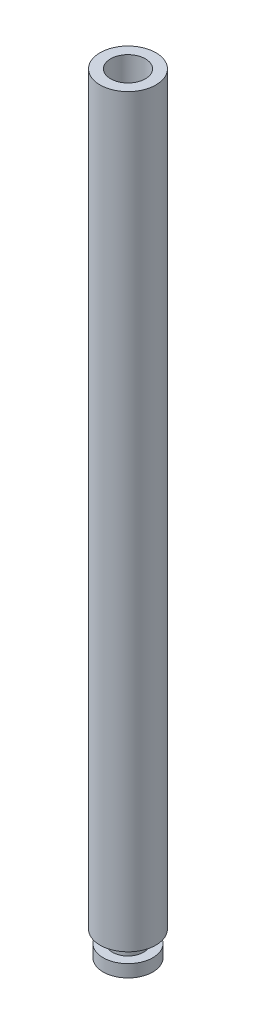
ISO-10303-21;
HEADER;
FILE_DESCRIPTION(('STEP AP214'),'2;1');
FILE_NAME('part.step','',(''),(''),'','','');
FILE_SCHEMA(('AUTOMOTIVE_DESIGN { 1 0 10303 214 1 1 1 1 }'));
ENDSEC;
DATA;
#1=APPLICATION_CONTEXT('core data for automotive mechanical design processes');
#2=APPLICATION_PROTOCOL_DEFINITION('international standard','automotive_design',2000,#1);
#3=PRODUCT_CONTEXT('',#1,'mechanical');
#4=PRODUCT('Part','Part','',(#3));
#5=PRODUCT_RELATED_PRODUCT_CATEGORY('part','',(#4));
#6=PRODUCT_DEFINITION_FORMATION('','',#4);
#7=PRODUCT_DEFINITION_CONTEXT('part definition',#1,'design');
#8=PRODUCT_DEFINITION('design','',#6,#7);
#9=PRODUCT_DEFINITION_SHAPE('','',#8);
#10=(LENGTH_UNIT() NAMED_UNIT(*) SI_UNIT(.MILLI.,.METRE.));
#11=(NAMED_UNIT(*) PLANE_ANGLE_UNIT() SI_UNIT($,.RADIAN.));
#12=(NAMED_UNIT(*) SI_UNIT($,.STERADIAN.) SOLID_ANGLE_UNIT());
#13=UNCERTAINTY_MEASURE_WITH_UNIT(LENGTH_MEASURE(1.E-05),#10,'distance_accuracy_value','');
#14=(GEOMETRIC_REPRESENTATION_CONTEXT(3) GLOBAL_UNCERTAINTY_ASSIGNED_CONTEXT((#13)) GLOBAL_UNIT_ASSIGNED_CONTEXT((#10,
#11,#12)) REPRESENTATION_CONTEXT('',''));
#15=CARTESIAN_POINT('',(0.,0.,0.));
#16=DIRECTION('',(0.,0.,1.));
#17=DIRECTION('',(1.,0.,0.));
#18=AXIS2_PLACEMENT_3D('',#15,#16,#17);
#19=CARTESIAN_POINT('',(-0.522013311509166,60.,-0.51113803418606));
#20=DIRECTION('',(0.,-1.,0.));
#21=DIRECTION('',(0.,0.,-1.));
#22=AXIS2_PLACEMENT_3D('',#19,#20,#21);
#23=CYLINDRICAL_SURFACE('',#22,2.25);
#24=CARTESIAN_POINT('',(-0.522013311509166,60.,-0.51113803418606));
#25=DIRECTION('',(0.,1.,0.));
#26=DIRECTION('',(0.,0.,1.));
#27=AXIS2_PLACEMENT_3D('',#24,#25,#26);
#28=CIRCLE('',#27,2.25);
#29=CARTESIAN_POINT('',(-0.522013311509166,60.,1.73886196581394));
#30=VERTEX_POINT('',#29);
#31=EDGE_CURVE('E53',#30,#30,#28,.T.);
#32=ORIENTED_EDGE('',*,*,#31,.F.);
#33=EDGE_LOOP('',(#32));
#34=FACE_BOUND('',#33,.T.);
#35=CARTESIAN_POINT('',(-0.522013311509166,0.,-0.51113803418606));
#36=DIRECTION('',(0.,1.,0.));
#37=DIRECTION('',(0.,0.,1.));
#38=AXIS2_PLACEMENT_3D('',#35,#36,#37);
#39=CIRCLE('',#38,2.25);
#40=CARTESIAN_POINT('',(-0.522013311509166,0.,1.73886196581394));
#41=VERTEX_POINT('',#40);
#42=EDGE_CURVE('E48',#41,#41,#39,.T.);
#43=ORIENTED_EDGE('',*,*,#42,.T.);
#44=EDGE_LOOP('',(#43));
#45=FACE_BOUND('',#44,.T.);
#46=ADVANCED_FACE('F45',(#34,#45),#23,.T.);
#47=CARTESIAN_POINT('',(-0.522013311509166,60.,-0.51113803418606));
#48=DIRECTION('',(0.,1.,0.));
#49=DIRECTION('',(0.,0.,1.));
#50=AXIS2_PLACEMENT_3D('',#47,#48,#49);
#51=PLANE('',#50);
#52=CARTESIAN_POINT('',(-0.522013311509166,60.,-0.51113803418606));
#53=DIRECTION('',(0.,1.,0.));
#54=DIRECTION('',(0.,0.,1.));
#55=AXIS2_PLACEMENT_3D('',#52,#53,#54);
#56=CIRCLE('',#55,1.4);
#57=CARTESIAN_POINT('',(-0.522013311509166,60.,0.88886196581394));
#58=VERTEX_POINT('',#57);
#59=EDGE_CURVE('E73',#58,#58,#56,.T.);
#60=ORIENTED_EDGE('',*,*,#59,.F.);
#61=EDGE_LOOP('',(#60));
#62=FACE_BOUND('',#61,.T.);
#63=ORIENTED_EDGE('',*,*,#31,.T.);
#64=EDGE_LOOP('',(#63));
#65=FACE_BOUND('',#64,.T.);
#66=ADVANCED_FACE('F90',(#62,#65),#51,.T.);
#67=CARTESIAN_POINT('',(-0.522013311509166,0.,-0.51113803418606));
#68=DIRECTION('',(0.,1.,0.));
#69=DIRECTION('',(0.,0.,1.));
#70=AXIS2_PLACEMENT_3D('',#67,#68,#69);
#71=PLANE('',#70);
#72=CARTESIAN_POINT('',(-0.522013311509166,0.,-0.51113803418606));
#73=DIRECTION('',(0.,-1.,0.));
#74=DIRECTION('',(0.,0.,-1.));
#75=AXIS2_PLACEMENT_3D('',#72,#73,#74);
#76=CIRCLE('',#75,1.25);
#77=CARTESIAN_POINT('',(-0.522013311509166,0.,-1.76113803418606));
#78=VERTEX_POINT('',#77);
#79=EDGE_CURVE('E10',#78,#78,#76,.T.);
#80=ORIENTED_EDGE('',*,*,#79,.F.);
#81=EDGE_LOOP('',(#80));
#82=FACE_BOUND('',#81,.T.);
#83=ORIENTED_EDGE('',*,*,#42,.F.);
#84=EDGE_LOOP('',(#83));
#85=FACE_BOUND('',#84,.T.);
#86=ADVANCED_FACE('F93',(#82,#85),#71,.F.);
#87=CARTESIAN_POINT('',(-0.522013311509166,-1.,-0.51113803418606));
#88=DIRECTION('',(0.,1.,0.));
#89=DIRECTION('',(0.,0.,1.));
#90=AXIS2_PLACEMENT_3D('',#87,#88,#89);
#91=CYLINDRICAL_SURFACE('',#90,1.25);
#92=CARTESIAN_POINT('',(-0.522013311509166,-1.,-0.51113803418606));
#93=DIRECTION('',(0.,-1.,0.));
#94=DIRECTION('',(0.,0.,-1.));
#95=AXIS2_PLACEMENT_3D('',#92,#93,#94);
#96=CIRCLE('',#95,1.25);
#97=CARTESIAN_POINT('',(-0.522013311509166,-1.,-1.76113803418606));
#98=VERTEX_POINT('',#97);
#99=EDGE_CURVE('E60',#98,#98,#96,.T.);
#100=ORIENTED_EDGE('',*,*,#99,.F.);
#101=EDGE_LOOP('',(#100));
#102=FACE_BOUND('',#101,.T.);
#103=ORIENTED_EDGE('',*,*,#79,.T.);
#104=EDGE_LOOP('',(#103));
#105=FACE_BOUND('',#104,.T.);
#106=ADVANCED_FACE('F104',(#102,#105),#91,.T.);
#107=CARTESIAN_POINT('',(-0.522013311509166,-2.,-0.51113803418606));
#108=DIRECTION('',(0.,1.,0.));
#109=DIRECTION('',(0.,0.,1.));
#110=AXIS2_PLACEMENT_3D('',#107,#108,#109);
#111=CYLINDRICAL_SURFACE('',#110,2.);
#112=CARTESIAN_POINT('',(-0.522013311509166,-2.,-0.51113803418606));
#113=DIRECTION('',(0.,-1.,0.));
#114=DIRECTION('',(0.,0.,-1.));
#115=AXIS2_PLACEMENT_3D('',#112,#113,#114);
#116=CIRCLE('',#115,2.);
#117=CARTESIAN_POINT('',(-0.522013311509166,-2.,-2.51113803418606));
#118=VERTEX_POINT('',#117);
#119=EDGE_CURVE('E64',#118,#118,#116,.T.);
#120=ORIENTED_EDGE('',*,*,#119,.F.);
#121=EDGE_LOOP('',(#120));
#122=FACE_BOUND('',#121,.T.);
#123=CARTESIAN_POINT('',(-0.522013311509166,-1.,-0.51113803418606));
#124=DIRECTION('',(0.,-1.,0.));
#125=DIRECTION('',(0.,0.,-1.));
#126=AXIS2_PLACEMENT_3D('',#123,#124,#125);
#127=CIRCLE('',#126,2.);
#128=CARTESIAN_POINT('',(-0.522013311509166,-1.,-2.51113803418606));
#129=VERTEX_POINT('',#128);
#130=EDGE_CURVE('E65',#129,#129,#127,.T.);
#131=ORIENTED_EDGE('',*,*,#130,.T.);
#132=EDGE_LOOP('',(#131));
#133=FACE_BOUND('',#132,.T.);
#134=ADVANCED_FACE('F109',(#122,#133),#111,.T.);
#135=CARTESIAN_POINT('',(-0.522013311509166,-2.,-0.51113803418606));
#136=DIRECTION('',(0.,-1.,0.));
#137=DIRECTION('',(0.,0.,-1.));
#138=AXIS2_PLACEMENT_3D('',#135,#136,#137);
#139=PLANE('',#138);
#140=ORIENTED_EDGE('',*,*,#119,.T.);
#141=EDGE_LOOP('',(#140));
#142=FACE_BOUND('',#141,.T.);
#143=ADVANCED_FACE('F115',(#142),#139,.T.);
#144=CARTESIAN_POINT('',(-0.522013311509166,-1.,-0.51113803418606));
#145=DIRECTION('',(0.,-1.,0.));
#146=DIRECTION('',(0.,0.,-1.));
#147=AXIS2_PLACEMENT_3D('',#144,#145,#146);
#148=PLANE('',#147);
#149=ORIENTED_EDGE('',*,*,#99,.T.);
#150=EDGE_LOOP('',(#149));
#151=FACE_BOUND('',#150,.T.);
#152=ORIENTED_EDGE('',*,*,#130,.F.);
#153=EDGE_LOOP('',(#152));
#154=FACE_BOUND('',#153,.T.);
#155=ADVANCED_FACE('F86',(#151,#154),#148,.F.);
#156=CARTESIAN_POINT('',(-0.522013311509166,45.,-0.51113803418606));
#157=DIRECTION('',(0.,1.,0.));
#158=DIRECTION('',(0.,0.,1.));
#159=AXIS2_PLACEMENT_3D('',#156,#157,#158);
#160=CYLINDRICAL_SURFACE('',#159,1.4);
#161=CARTESIAN_POINT('',(-0.522013311509166,45.,-0.51113803418606));
#162=DIRECTION('',(0.,1.,0.));
#163=DIRECTION('',(0.,0.,1.));
#164=AXIS2_PLACEMENT_3D('',#161,#162,#163);
#165=CIRCLE('',#164,1.4);
#166=CARTESIAN_POINT('',(-0.522013311509166,45.,0.88886196581394));
#167=VERTEX_POINT('',#166);
#168=EDGE_CURVE('E69',#167,#167,#165,.T.);
#169=ORIENTED_EDGE('',*,*,#168,.F.);
#170=EDGE_LOOP('',(#169));
#171=FACE_BOUND('',#170,.T.);
#172=ORIENTED_EDGE('',*,*,#59,.T.);
#173=EDGE_LOOP('',(#172));
#174=FACE_BOUND('',#173,.T.);
#175=ADVANCED_FACE('F83',(#171,#174),#160,.F.);
#176=CARTESIAN_POINT('',(-0.522013311509166,45.,-0.51113803418606));
#177=DIRECTION('',(0.,1.,0.));
#178=DIRECTION('',(0.,0.,1.));
#179=AXIS2_PLACEMENT_3D('',#176,#177,#178);
#180=PLANE('',#179);
#181=ORIENTED_EDGE('',*,*,#168,.T.);
#182=EDGE_LOOP('',(#181));
#183=FACE_BOUND('',#182,.T.);
#184=ADVANCED_FACE('F81',(#183),#180,.T.);
#185=CLOSED_SHELL('',(#46,#66,#86,#106,#134,#143,#155,#175,#184));
#186=MANIFOLD_SOLID_BREP('B2',#185);
#187=ADVANCED_BREP_SHAPE_REPRESENTATION('',(#18,#186),#14);
#188=SHAPE_DEFINITION_REPRESENTATION(#9,#187);
ENDSEC;
END-ISO-10303-21;
